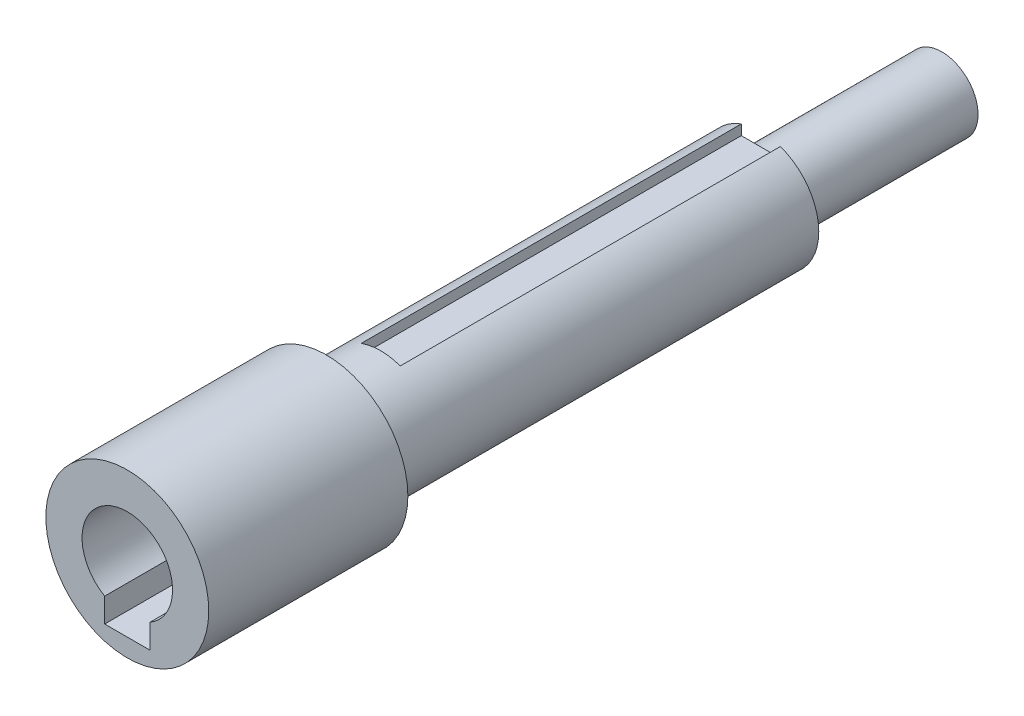
ISO-10303-21;
HEADER;
FILE_DESCRIPTION(('STEP AP214'),'2;1');
FILE_NAME('part.step','',(''),(''),'','','');
FILE_SCHEMA(('AUTOMOTIVE_DESIGN { 1 0 10303 214 1 1 1 1 }'));
ENDSEC;
DATA;
#1=APPLICATION_CONTEXT('core data for automotive mechanical design processes');
#2=APPLICATION_PROTOCOL_DEFINITION('international standard','automotive_design',2000,#1);
#3=PRODUCT_CONTEXT('',#1,'mechanical');
#4=PRODUCT('Part','Part','',(#3));
#5=PRODUCT_RELATED_PRODUCT_CATEGORY('part','',(#4));
#6=PRODUCT_DEFINITION_FORMATION('','',#4);
#7=PRODUCT_DEFINITION_CONTEXT('part definition',#1,'design');
#8=PRODUCT_DEFINITION('design','',#6,#7);
#9=PRODUCT_DEFINITION_SHAPE('','',#8);
#10=(LENGTH_UNIT() NAMED_UNIT(*) SI_UNIT(.MILLI.,.METRE.));
#11=(NAMED_UNIT(*) PLANE_ANGLE_UNIT() SI_UNIT($,.RADIAN.));
#12=(NAMED_UNIT(*) SI_UNIT($,.STERADIAN.) SOLID_ANGLE_UNIT());
#13=UNCERTAINTY_MEASURE_WITH_UNIT(LENGTH_MEASURE(1.E-05),#10,'distance_accuracy_value','');
#14=(GEOMETRIC_REPRESENTATION_CONTEXT(3) GLOBAL_UNCERTAINTY_ASSIGNED_CONTEXT((#13)) GLOBAL_UNIT_ASSIGNED_CONTEXT((#10,
#11,#12)) REPRESENTATION_CONTEXT('',''));
#15=CARTESIAN_POINT('',(0.,0.,0.));
#16=DIRECTION('',(0.,0.,1.));
#17=DIRECTION('',(1.,0.,0.));
#18=AXIS2_PLACEMENT_3D('',#15,#16,#17);
#19=CARTESIAN_POINT('',(0.,0.,20.));
#20=DIRECTION('',(0.,0.,1.));
#21=DIRECTION('',(1.,0.,0.));
#22=AXIS2_PLACEMENT_3D('',#19,#20,#21);
#23=PLANE('',#22);
#24=DIRECTION('',(0.,1.,0.));
#25=VECTOR('',#24,1.);
#26=CARTESIAN_POINT('',(2.5,-4.33012701892219,20.));
#27=LINE('',#26,#25);
#28=CARTESIAN_POINT('',(2.5,-7.,20.));
#29=VERTEX_POINT('',#28);
#30=CARTESIAN_POINT('',(2.5,-4.33012701892219,20.));
#31=VERTEX_POINT('',#30);
#32=EDGE_CURVE('E140',#29,#31,#27,.T.);
#33=ORIENTED_EDGE('',*,*,#32,.F.);
#34=DIRECTION('',(1.,0.,0.));
#35=VECTOR('',#34,1.);
#36=CARTESIAN_POINT('',(0.,-7.,20.));
#37=LINE('',#36,#35);
#38=CARTESIAN_POINT('',(-2.5,-7.,20.));
#39=VERTEX_POINT('',#38);
#40=EDGE_CURVE('E146',#39,#29,#37,.T.);
#41=ORIENTED_EDGE('',*,*,#40,.F.);
#42=DIRECTION('',(0.,-1.,0.));
#43=VECTOR('',#42,1.);
#44=CARTESIAN_POINT('',(-2.5,-7.,20.));
#45=LINE('',#44,#43);
#46=CARTESIAN_POINT('',(-2.5,-4.33012701892219,20.));
#47=VERTEX_POINT('',#46);
#48=EDGE_CURVE('E135',#47,#39,#45,.T.);
#49=ORIENTED_EDGE('',*,*,#48,.F.);
#50=CARTESIAN_POINT('',(0.,0.,20.));
#51=DIRECTION('',(0.,0.,1.));
#52=DIRECTION('',(1.,0.,0.));
#53=AXIS2_PLACEMENT_3D('',#50,#51,#52);
#54=CIRCLE('',#53,5.);
#55=EDGE_CURVE('E161',#31,#47,#54,.T.);
#56=ORIENTED_EDGE('',*,*,#55,.F.);
#57=EDGE_LOOP('',(#33,#41,#49,#56));
#58=FACE_BOUND('',#57,.T.);
#59=CARTESIAN_POINT('',(0.,0.,20.));
#60=DIRECTION('',(0.,0.,1.));
#61=DIRECTION('',(1.,0.,0.));
#62=AXIS2_PLACEMENT_3D('',#59,#60,#61);
#63=CIRCLE('',#62,9.);
#64=CARTESIAN_POINT('',(9.,0.,20.));
#65=VERTEX_POINT('',#64);
#66=EDGE_CURVE('E164',#65,#65,#63,.T.);
#67=ORIENTED_EDGE('',*,*,#66,.T.);
#68=EDGE_LOOP('',(#67));
#69=FACE_BOUND('',#68,.T.);
#70=ADVANCED_FACE('F33',(#58,#69),#23,.T.);
#71=CARTESIAN_POINT('',(0.,0.,20.));
#72=DIRECTION('',(0.,0.,-1.));
#73=DIRECTION('',(-1.,0.,0.));
#74=AXIS2_PLACEMENT_3D('',#71,#72,#73);
#75=CYLINDRICAL_SURFACE('',#74,9.);
#76=ORIENTED_EDGE('',*,*,#66,.F.);
#77=EDGE_LOOP('',(#76));
#78=FACE_BOUND('',#77,.T.);
#79=CARTESIAN_POINT('',(0.,0.,-1.99999999999999));
#80=DIRECTION('',(0.,0.,1.));
#81=DIRECTION('',(1.,0.,0.));
#82=AXIS2_PLACEMENT_3D('',#79,#80,#81);
#83=CIRCLE('',#82,9.);
#84=CARTESIAN_POINT('',(9.,0.,-1.99999999999999));
#85=VERTEX_POINT('',#84);
#86=EDGE_CURVE('E114',#85,#85,#83,.T.);
#87=ORIENTED_EDGE('',*,*,#86,.T.);
#88=EDGE_LOOP('',(#87));
#89=FACE_BOUND('',#88,.T.);
#90=ADVANCED_FACE('F35',(#78,#89),#75,.T.);
#91=CARTESIAN_POINT('',(0.,0.,20.));
#92=DIRECTION('',(0.,0.,-1.));
#93=DIRECTION('',(-1.,0.,0.));
#94=AXIS2_PLACEMENT_3D('',#91,#92,#93);
#95=CYLINDRICAL_SURFACE('',#94,5.);
#96=CARTESIAN_POINT('',(0.,0.,1.99999999999999));
#97=DIRECTION('',(0.,0.,1.));
#98=DIRECTION('',(1.,0.,0.));
#99=AXIS2_PLACEMENT_3D('',#96,#97,#98);
#100=CIRCLE('',#99,5.);
#101=CARTESIAN_POINT('',(5.,0.,1.99999999999999));
#102=VERTEX_POINT('',#101);
#103=EDGE_CURVE('E41',#102,#102,#100,.T.);
#104=ORIENTED_EDGE('',*,*,#103,.F.);
#105=EDGE_LOOP('',(#104));
#106=FACE_BOUND('',#105,.T.);
#107=DIRECTION('',(0.,0.,1.));
#108=VECTOR('',#107,1.);
#109=CARTESIAN_POINT('',(2.5,-4.33012701892219,4.));
#110=LINE('',#109,#108);
#111=CARTESIAN_POINT('',(2.5,-4.33012701892219,4.));
#112=VERTEX_POINT('',#111);
#113=EDGE_CURVE('E150',#112,#31,#110,.T.);
#114=ORIENTED_EDGE('',*,*,#113,.T.);
#115=ORIENTED_EDGE('',*,*,#55,.T.);
#116=DIRECTION('',(0.,0.,1.));
#117=VECTOR('',#116,1.);
#118=CARTESIAN_POINT('',(-2.5,-4.33012701892219,4.));
#119=LINE('',#118,#117);
#120=CARTESIAN_POINT('',(-2.5,-4.33012701892219,4.));
#121=VERTEX_POINT('',#120);
#122=EDGE_CURVE('E143',#121,#47,#119,.T.);
#123=ORIENTED_EDGE('',*,*,#122,.F.);
#124=CARTESIAN_POINT('',(0.,0.,4.));
#125=DIRECTION('',(0.,0.,-1.));
#126=DIRECTION('',(-1.,0.,0.));
#127=AXIS2_PLACEMENT_3D('',#124,#125,#126);
#128=CIRCLE('',#127,5.);
#129=EDGE_CURVE('E167',#112,#121,#128,.T.);
#130=ORIENTED_EDGE('',*,*,#129,.F.);
#131=EDGE_LOOP('',(#114,#115,#123,#130));
#132=FACE_BOUND('',#131,.T.);
#133=ADVANCED_FACE('F176',(#106,#132),#95,.F.);
#134=CARTESIAN_POINT('',(2.5,-4.33012701892219,4.));
#135=DIRECTION('',(1.,0.,0.));
#136=DIRECTION('',(0.,1.,0.));
#137=AXIS2_PLACEMENT_3D('',#134,#135,#136);
#138=PLANE('',#137);
#139=ORIENTED_EDGE('',*,*,#32,.T.);
#140=ORIENTED_EDGE('',*,*,#113,.F.);
#141=DIRECTION('',(0.,1.,0.));
#142=VECTOR('',#141,1.);
#143=CARTESIAN_POINT('',(2.5,-4.33012701892219,4.));
#144=LINE('',#143,#142);
#145=CARTESIAN_POINT('',(2.5,-7.,4.));
#146=VERTEX_POINT('',#145);
#147=EDGE_CURVE('E55',#146,#112,#144,.T.);
#148=ORIENTED_EDGE('',*,*,#147,.F.);
#149=DIRECTION('',(0.,0.,1.));
#150=VECTOR('',#149,1.);
#151=CARTESIAN_POINT('',(2.5,-7.,4.));
#152=LINE('',#151,#150);
#153=EDGE_CURVE('E154',#146,#29,#152,.T.);
#154=ORIENTED_EDGE('',*,*,#153,.T.);
#155=EDGE_LOOP('',(#139,#140,#148,#154));
#156=FACE_BOUND('',#155,.T.);
#157=ADVANCED_FACE('F179',(#156),#138,.F.);
#158=CARTESIAN_POINT('',(0.,-7.,4.));
#159=DIRECTION('',(0.,-1.,0.));
#160=DIRECTION('',(0.,0.,-1.));
#161=AXIS2_PLACEMENT_3D('',#158,#159,#160);
#162=PLANE('',#161);
#163=ORIENTED_EDGE('',*,*,#40,.T.);
#164=ORIENTED_EDGE('',*,*,#153,.F.);
#165=DIRECTION('',(1.,0.,0.));
#166=VECTOR('',#165,1.);
#167=CARTESIAN_POINT('',(0.,-7.,4.));
#168=LINE('',#167,#166);
#169=CARTESIAN_POINT('',(-2.5,-7.,4.));
#170=VERTEX_POINT('',#169);
#171=EDGE_CURVE('E139',#170,#146,#168,.T.);
#172=ORIENTED_EDGE('',*,*,#171,.F.);
#173=DIRECTION('',(0.,0.,1.));
#174=VECTOR('',#173,1.);
#175=CARTESIAN_POINT('',(-2.5,-7.,4.));
#176=LINE('',#175,#174);
#177=EDGE_CURVE('E156',#170,#39,#176,.T.);
#178=ORIENTED_EDGE('',*,*,#177,.T.);
#179=EDGE_LOOP('',(#163,#164,#172,#178));
#180=FACE_BOUND('',#179,.T.);
#181=ADVANCED_FACE('F197',(#180),#162,.F.);
#182=CARTESIAN_POINT('',(-2.5,-7.,4.));
#183=DIRECTION('',(-1.,0.,0.));
#184=DIRECTION('',(0.,0.,1.));
#185=AXIS2_PLACEMENT_3D('',#182,#183,#184);
#186=PLANE('',#185);
#187=ORIENTED_EDGE('',*,*,#48,.T.);
#188=ORIENTED_EDGE('',*,*,#177,.F.);
#189=DIRECTION('',(0.,-1.,0.));
#190=VECTOR('',#189,1.);
#191=CARTESIAN_POINT('',(-2.5,-7.,4.));
#192=LINE('',#191,#190);
#193=EDGE_CURVE('E136',#121,#170,#192,.T.);
#194=ORIENTED_EDGE('',*,*,#193,.F.);
#195=ORIENTED_EDGE('',*,*,#122,.T.);
#196=EDGE_LOOP('',(#187,#188,#194,#195));
#197=FACE_BOUND('',#196,.T.);
#198=ADVANCED_FACE('F191',(#197),#186,.F.);
#199=CARTESIAN_POINT('',(0.,0.,4.));
#200=DIRECTION('',(0.,0.,-1.));
#201=DIRECTION('',(-1.,0.,0.));
#202=AXIS2_PLACEMENT_3D('',#199,#200,#201);
#203=PLANE('',#202);
#204=ORIENTED_EDGE('',*,*,#129,.T.);
#205=ORIENTED_EDGE('',*,*,#193,.T.);
#206=ORIENTED_EDGE('',*,*,#171,.T.);
#207=ORIENTED_EDGE('',*,*,#147,.T.);
#208=EDGE_LOOP('',(#204,#205,#206,#207));
#209=FACE_BOUND('',#208,.T.);
#210=ADVANCED_FACE('F194',(#209),#203,.F.);
#211=CARTESIAN_POINT('',(0.,0.,-1.99999999999999));
#212=DIRECTION('',(0.,0.,1.));
#213=DIRECTION('',(1.,0.,0.));
#214=AXIS2_PLACEMENT_3D('',#211,#212,#213);
#215=PLANE('',#214);
#216=CARTESIAN_POINT('',(0.,0.,-1.99999999999999));
#217=DIRECTION('',(0.,0.,1.));
#218=DIRECTION('',(1.,0.,0.));
#219=AXIS2_PLACEMENT_3D('',#216,#217,#218);
#220=CIRCLE('',#219,6.4);
#221=CARTESIAN_POINT('',(6.4,0.,-1.99999999999999));
#222=VERTEX_POINT('',#221);
#223=EDGE_CURVE('E169',#222,#222,#220,.T.);
#224=ORIENTED_EDGE('',*,*,#223,.T.);
#225=EDGE_LOOP('',(#224));
#226=FACE_BOUND('',#225,.T.);
#227=ORIENTED_EDGE('',*,*,#86,.F.);
#228=EDGE_LOOP('',(#227));
#229=FACE_BOUND('',#228,.T.);
#230=ADVANCED_FACE('F218',(#226,#229),#215,.F.);
#231=CARTESIAN_POINT('',(0.,0.,-50.));
#232=DIRECTION('',(0.,0.,-1.));
#233=DIRECTION('',(-1.,0.,0.));
#234=AXIS2_PLACEMENT_3D('',#231,#232,#233);
#235=PLANE('',#234);
#236=CARTESIAN_POINT('',(0.,0.,-50.));
#237=DIRECTION('',(0.,0.,-1.));
#238=DIRECTION('',(-1.,0.,0.));
#239=AXIS2_PLACEMENT_3D('',#236,#237,#238);
#240=CIRCLE('',#239,4.);
#241=CARTESIAN_POINT('',(-4.,0.,-50.));
#242=VERTEX_POINT('',#241);
#243=EDGE_CURVE('E253',#242,#242,#240,.T.);
#244=ORIENTED_EDGE('',*,*,#243,.F.);
#245=EDGE_LOOP('',(#244));
#246=FACE_BOUND('',#245,.T.);
#247=DIRECTION('',(0.,-1.,0.));
#248=VECTOR('',#247,1.);
#249=CARTESIAN_POINT('',(2.16,6.02448338034059,-50.));
#250=LINE('',#249,#248);
#251=CARTESIAN_POINT('',(2.16,6.02448338034059,-50.));
#252=VERTEX_POINT('',#251);
#253=CARTESIAN_POINT('',(2.16,4.9,-50.));
#254=VERTEX_POINT('',#253);
#255=EDGE_CURVE('E112',#252,#254,#250,.T.);
#256=ORIENTED_EDGE('',*,*,#255,.F.);
#257=CARTESIAN_POINT('',(0.,0.,-50.));
#258=DIRECTION('',(0.,0.,-1.));
#259=DIRECTION('',(-1.,0.,0.));
#260=AXIS2_PLACEMENT_3D('',#257,#258,#259);
#261=CIRCLE('',#260,6.4);
#262=CARTESIAN_POINT('',(-2.16,6.02448338034059,-50.));
#263=VERTEX_POINT('',#262);
#264=EDGE_CURVE('E153',#252,#263,#261,.T.);
#265=ORIENTED_EDGE('',*,*,#264,.T.);
#266=DIRECTION('',(0.,1.,0.));
#267=VECTOR('',#266,1.);
#268=CARTESIAN_POINT('',(-2.16,4.9,-50.));
#269=LINE('',#268,#267);
#270=CARTESIAN_POINT('',(-2.16,4.9,-50.));
#271=VERTEX_POINT('',#270);
#272=EDGE_CURVE('E124',#271,#263,#269,.T.);
#273=ORIENTED_EDGE('',*,*,#272,.F.);
#274=DIRECTION('',(-1.,0.,0.));
#275=VECTOR('',#274,1.);
#276=CARTESIAN_POINT('',(0.,4.9,-50.));
#277=LINE('',#276,#275);
#278=EDGE_CURVE('E105',#254,#271,#277,.T.);
#279=ORIENTED_EDGE('',*,*,#278,.F.);
#280=EDGE_LOOP('',(#256,#265,#273,#279));
#281=FACE_BOUND('',#280,.T.);
#282=ADVANCED_FACE('F214',(#246,#281),#235,.T.);
#283=CARTESIAN_POINT('',(0.,0.,-50.));
#284=DIRECTION('',(0.,0.,1.));
#285=DIRECTION('',(1.,0.,0.));
#286=AXIS2_PLACEMENT_3D('',#283,#284,#285);
#287=CYLINDRICAL_SURFACE('',#286,6.4);
#288=ORIENTED_EDGE('',*,*,#264,.F.);
#289=DIRECTION('',(0.,0.,-1.));
#290=VECTOR('',#289,1.);
#291=CARTESIAN_POINT('',(2.16,6.02448338034059,-7.99999999999999));
#292=LINE('',#291,#290);
#293=CARTESIAN_POINT('',(2.16,6.02448338034059,-7.99999999999999));
#294=VERTEX_POINT('',#293);
#295=EDGE_CURVE('E115',#294,#252,#292,.T.);
#296=ORIENTED_EDGE('',*,*,#295,.F.);
#297=CARTESIAN_POINT('',(0.,0.,-7.99999999999999));
#298=DIRECTION('',(0.,0.,-1.));
#299=DIRECTION('',(-1.,0.,0.));
#300=AXIS2_PLACEMENT_3D('',#297,#298,#299);
#301=CIRCLE('',#300,6.4);
#302=CARTESIAN_POINT('',(-2.16,6.02448338034059,-7.99999999999999));
#303=VERTEX_POINT('',#302);
#304=EDGE_CURVE('E11',#303,#294,#301,.T.);
#305=ORIENTED_EDGE('',*,*,#304,.F.);
#306=DIRECTION('',(0.,0.,-1.));
#307=VECTOR('',#306,1.);
#308=CARTESIAN_POINT('',(-2.16,6.02448338034059,-7.99999999999999));
#309=LINE('',#308,#307);
#310=EDGE_CURVE('E129',#303,#263,#309,.T.);
#311=ORIENTED_EDGE('',*,*,#310,.T.);
#312=EDGE_LOOP('',(#288,#296,#305,#311));
#313=FACE_BOUND('',#312,.T.);
#314=ORIENTED_EDGE('',*,*,#223,.F.);
#315=EDGE_LOOP('',(#314));
#316=FACE_BOUND('',#315,.T.);
#317=ADVANCED_FACE('F211',(#313,#316),#287,.T.);
#318=CARTESIAN_POINT('',(0.,0.,1.99999999999999));
#319=DIRECTION('',(0.,0.,1.));
#320=DIRECTION('',(1.,0.,0.));
#321=AXIS2_PLACEMENT_3D('',#318,#319,#320);
#322=PLANE('',#321);
#323=ORIENTED_EDGE('',*,*,#103,.T.);
#324=EDGE_LOOP('',(#323));
#325=FACE_BOUND('',#324,.T.);
#326=ADVANCED_FACE('F174',(#325),#322,.T.);
#327=CARTESIAN_POINT('',(0.,0.,-7.99999999999999));
#328=DIRECTION('',(0.,0.,-1.));
#329=DIRECTION('',(-1.,0.,0.));
#330=AXIS2_PLACEMENT_3D('',#327,#328,#329);
#331=PLANE('',#330);
#332=ORIENTED_EDGE('',*,*,#304,.T.);
#333=DIRECTION('',(0.,-1.,0.));
#334=VECTOR('',#333,1.);
#335=CARTESIAN_POINT('',(2.16,6.02448338034059,-7.99999999999999));
#336=LINE('',#335,#334);
#337=CARTESIAN_POINT('',(2.16,4.9,-7.99999999999999));
#338=VERTEX_POINT('',#337);
#339=EDGE_CURVE('E104',#294,#338,#336,.T.);
#340=ORIENTED_EDGE('',*,*,#339,.T.);
#341=DIRECTION('',(1.,0.,0.));
#342=VECTOR('',#341,1.);
#343=CARTESIAN_POINT('',(0.,4.9,-7.99999999999999));
#344=LINE('',#343,#342);
#345=CARTESIAN_POINT('',(-2.16,4.9,-7.99999999999999));
#346=VERTEX_POINT('',#345);
#347=EDGE_CURVE('E96',#346,#338,#344,.T.);
#348=ORIENTED_EDGE('',*,*,#347,.F.);
#349=DIRECTION('',(0.,1.,0.));
#350=VECTOR('',#349,1.);
#351=CARTESIAN_POINT('',(-2.16,4.9,-7.99999999999999));
#352=LINE('',#351,#350);
#353=EDGE_CURVE('E47',#346,#303,#352,.T.);
#354=ORIENTED_EDGE('',*,*,#353,.T.);
#355=EDGE_LOOP('',(#332,#340,#348,#354));
#356=FACE_BOUND('',#355,.T.);
#357=ADVANCED_FACE('F117',(#356),#331,.T.);
#358=CARTESIAN_POINT('',(2.16,6.02448338034059,-7.99999999999999));
#359=DIRECTION('',(1.,0.,0.));
#360=DIRECTION('',(0.,0.,-1.));
#361=AXIS2_PLACEMENT_3D('',#358,#359,#360);
#362=PLANE('',#361);
#363=ORIENTED_EDGE('',*,*,#255,.T.);
#364=DIRECTION('',(0.,0.,-1.));
#365=VECTOR('',#364,1.);
#366=CARTESIAN_POINT('',(2.16,4.9,-7.99999999999999));
#367=LINE('',#366,#365);
#368=EDGE_CURVE('E100',#338,#254,#367,.T.);
#369=ORIENTED_EDGE('',*,*,#368,.F.);
#370=ORIENTED_EDGE('',*,*,#339,.F.);
#371=ORIENTED_EDGE('',*,*,#295,.T.);
#372=EDGE_LOOP('',(#363,#369,#370,#371));
#373=FACE_BOUND('',#372,.T.);
#374=ADVANCED_FACE('F109',(#373),#362,.F.);
#375=CARTESIAN_POINT('',(-2.16,4.9,-7.99999999999999));
#376=DIRECTION('',(-1.,0.,0.));
#377=DIRECTION('',(0.,0.,1.));
#378=AXIS2_PLACEMENT_3D('',#375,#376,#377);
#379=PLANE('',#378);
#380=ORIENTED_EDGE('',*,*,#272,.T.);
#381=ORIENTED_EDGE('',*,*,#310,.F.);
#382=ORIENTED_EDGE('',*,*,#353,.F.);
#383=DIRECTION('',(0.,0.,-1.));
#384=VECTOR('',#383,1.);
#385=CARTESIAN_POINT('',(-2.16,4.9,-7.99999999999999));
#386=LINE('',#385,#384);
#387=EDGE_CURVE('E102',#346,#271,#386,.T.);
#388=ORIENTED_EDGE('',*,*,#387,.T.);
#389=EDGE_LOOP('',(#380,#381,#382,#388));
#390=FACE_BOUND('',#389,.T.);
#391=ADVANCED_FACE('F234',(#390),#379,.F.);
#392=CARTESIAN_POINT('',(0.,4.9,-7.99999999999999));
#393=DIRECTION('',(0.,-1.,0.));
#394=DIRECTION('',(0.,0.,-1.));
#395=AXIS2_PLACEMENT_3D('',#392,#393,#394);
#396=PLANE('',#395);
#397=ORIENTED_EDGE('',*,*,#278,.T.);
#398=ORIENTED_EDGE('',*,*,#387,.F.);
#399=ORIENTED_EDGE('',*,*,#347,.T.);
#400=ORIENTED_EDGE('',*,*,#368,.T.);
#401=EDGE_LOOP('',(#397,#398,#399,#400));
#402=FACE_BOUND('',#401,.T.);
#403=ADVANCED_FACE('F99',(#402),#396,.F.);
#404=CARTESIAN_POINT('',(0.,0.,-70.));
#405=DIRECTION('',(0.,0.,1.));
#406=DIRECTION('',(1.,0.,0.));
#407=AXIS2_PLACEMENT_3D('',#404,#405,#406);
#408=CYLINDRICAL_SURFACE('',#407,4.);
#409=CARTESIAN_POINT('',(0.,0.,-70.));
#410=DIRECTION('',(0.,0.,-1.));
#411=DIRECTION('',(-1.,0.,0.));
#412=AXIS2_PLACEMENT_3D('',#409,#410,#411);
#413=CIRCLE('',#412,4.);
#414=CARTESIAN_POINT('',(-4.,0.,-70.));
#415=VERTEX_POINT('',#414);
#416=EDGE_CURVE('E125',#415,#415,#413,.T.);
#417=ORIENTED_EDGE('',*,*,#416,.F.);
#418=EDGE_LOOP('',(#417));
#419=FACE_BOUND('',#418,.T.);
#420=ORIENTED_EDGE('',*,*,#243,.T.);
#421=EDGE_LOOP('',(#420));
#422=FACE_BOUND('',#421,.T.);
#423=ADVANCED_FACE('F240',(#419,#422),#408,.T.);
#424=CARTESIAN_POINT('',(0.,0.,-70.));
#425=DIRECTION('',(0.,0.,-1.));
#426=DIRECTION('',(-1.,0.,0.));
#427=AXIS2_PLACEMENT_3D('',#424,#425,#426);
#428=PLANE('',#427);
#429=ORIENTED_EDGE('',*,*,#416,.T.);
#430=EDGE_LOOP('',(#429));
#431=FACE_BOUND('',#430,.T.);
#432=ADVANCED_FACE('F245',(#431),#428,.T.);
#433=CLOSED_SHELL('',(#70,#90,#133,#157,#181,#198,#210,#230,#282,#317,#326,#357,#374,#391,#403,
#423,#432));
#434=MANIFOLD_SOLID_BREP('B2',#433);
#435=ADVANCED_BREP_SHAPE_REPRESENTATION('',(#18,#434),#14);
#436=SHAPE_DEFINITION_REPRESENTATION(#9,#435);
ENDSEC;
END-ISO-10303-21;
